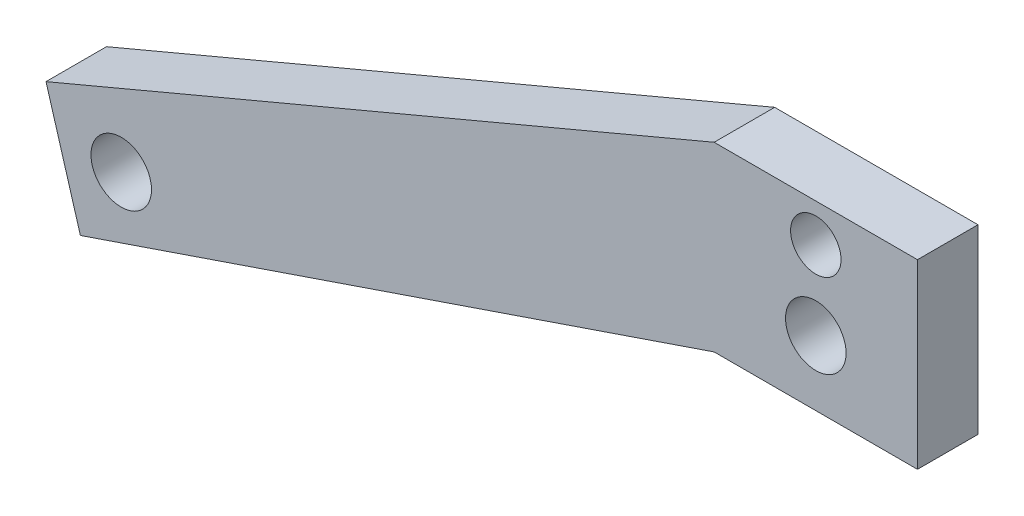
ISO-10303-21;
HEADER;
FILE_DESCRIPTION(('STEP AP214'),'2;1');
FILE_NAME('part.step','',(''),(''),'','','');
FILE_SCHEMA(('AUTOMOTIVE_DESIGN { 1 0 10303 214 1 1 1 1 }'));
ENDSEC;
DATA;
#1=APPLICATION_CONTEXT('core data for automotive mechanical design processes');
#2=APPLICATION_PROTOCOL_DEFINITION('international standard','automotive_design',2000,#1);
#3=PRODUCT_CONTEXT('',#1,'mechanical');
#4=PRODUCT('Part','Part','',(#3));
#5=PRODUCT_RELATED_PRODUCT_CATEGORY('part','',(#4));
#6=PRODUCT_DEFINITION_FORMATION('','',#4);
#7=PRODUCT_DEFINITION_CONTEXT('part definition',#1,'design');
#8=PRODUCT_DEFINITION('design','',#6,#7);
#9=PRODUCT_DEFINITION_SHAPE('','',#8);
#10=(LENGTH_UNIT() NAMED_UNIT(*) SI_UNIT(.MILLI.,.METRE.));
#11=(NAMED_UNIT(*) PLANE_ANGLE_UNIT() SI_UNIT($,.RADIAN.));
#12=(NAMED_UNIT(*) SI_UNIT($,.STERADIAN.) SOLID_ANGLE_UNIT());
#13=UNCERTAINTY_MEASURE_WITH_UNIT(LENGTH_MEASURE(1.E-05),#10,'distance_accuracy_value','');
#14=(GEOMETRIC_REPRESENTATION_CONTEXT(3) GLOBAL_UNCERTAINTY_ASSIGNED_CONTEXT((#13)) GLOBAL_UNIT_ASSIGNED_CONTEXT((#10,
#11,#12)) REPRESENTATION_CONTEXT('',''));
#15=CARTESIAN_POINT('',(0.,0.,0.));
#16=DIRECTION('',(0.,0.,1.));
#17=DIRECTION('',(1.,0.,0.));
#18=AXIS2_PLACEMENT_3D('',#15,#16,#17);
#19=CARTESIAN_POINT('',(-111.181731184165,-32.9335291699961,9.525));
#20=DIRECTION('',(-0.958819734868193,-0.284015344703924,0.));
#21=DIRECTION('',(0.284015344703924,-0.958819734868193,0.));
#22=AXIS2_PLACEMENT_3D('',#19,#20,#21);
#23=PLANE('',#22);
#24=DIRECTION('',(-0.284015344703924,0.958819734868193,0.));
#25=VECTOR('',#24,1.);
#26=CARTESIAN_POINT('',(-111.181731184165,-32.9335291699961,0.));
#27=LINE('',#26,#25);
#28=CARTESIAN_POINT('',(-115.733139183861,-17.5682332698922,0.));
#29=VERTEX_POINT('',#28);
#30=CARTESIAN_POINT('',(-121.143631500471,0.697282679346885,0.));
#31=VERTEX_POINT('',#30);
#32=EDGE_CURVE('E129',#29,#31,#27,.T.);
#33=ORIENTED_EDGE('',*,*,#32,.F.);
#34=DIRECTION('',(0.,0.,-1.));
#35=VECTOR('',#34,1.);
#36=CARTESIAN_POINT('',(-115.733139183861,-17.5682332698922,9.525));
#37=LINE('',#36,#35);
#38=CARTESIAN_POINT('',(-115.733139183861,-17.5682332698922,9.525));
#39=VERTEX_POINT('',#38);
#40=EDGE_CURVE('E11',#39,#29,#37,.T.);
#41=ORIENTED_EDGE('',*,*,#40,.F.);
#42=DIRECTION('',(-0.284015344703924,0.958819734868193,0.));
#43=VECTOR('',#42,1.);
#44=CARTESIAN_POINT('',(-111.181731184165,-32.9335291699961,9.525));
#45=LINE('',#44,#43);
#46=CARTESIAN_POINT('',(-121.143631500471,0.697282679346885,9.525));
#47=VERTEX_POINT('',#46);
#48=EDGE_CURVE('E253',#39,#47,#45,.T.);
#49=ORIENTED_EDGE('',*,*,#48,.T.);
#50=DIRECTION('',(0.,0.,-1.));
#51=VECTOR('',#50,1.);
#52=CARTESIAN_POINT('',(-121.143631500471,0.697282679346885,9.525));
#53=LINE('',#52,#51);
#54=EDGE_CURVE('E79',#47,#31,#53,.T.);
#55=ORIENTED_EDGE('',*,*,#54,.T.);
#56=EDGE_LOOP('',(#33,#41,#49,#55));
#57=FACE_BOUND('',#56,.T.);
#58=ADVANCED_FACE('F34',(#57),#23,.T.);
#59=CARTESIAN_POINT('',(-6.68093946845817,19.6012995194307,9.525));
#60=DIRECTION('',(0.322616747331422,-0.946529679588175,0.));
#61=DIRECTION('',(0.946529679588175,0.322616747331422,0.));
#62=AXIS2_PLACEMENT_3D('',#59,#60,#61);
#63=PLANE('',#62);
#64=DIRECTION('',(-0.946529679588175,-0.322616747331422,0.));
#65=VECTOR('',#64,1.);
#66=CARTESIAN_POINT('',(-6.68093946845817,19.6012995194307,0.));
#67=LINE('',#66,#65);
#68=CARTESIAN_POINT('',(-15.9999937728734,16.4249775796861,0.));
#69=VERTEX_POINT('',#68);
#70=EDGE_CURVE('E127',#69,#29,#67,.T.);
#71=ORIENTED_EDGE('',*,*,#70,.F.);
#72=DIRECTION('',(0.,0.,-1.));
#73=VECTOR('',#72,1.);
#74=CARTESIAN_POINT('',(-15.9999937728734,16.4249775796861,9.525));
#75=LINE('',#74,#73);
#76=CARTESIAN_POINT('',(-15.9999937728734,16.4249775796861,9.525));
#77=VERTEX_POINT('',#76);
#78=EDGE_CURVE('E43',#77,#69,#75,.T.);
#79=ORIENTED_EDGE('',*,*,#78,.F.);
#80=DIRECTION('',(-0.946529679588175,-0.322616747331422,0.));
#81=VECTOR('',#80,1.);
#82=CARTESIAN_POINT('',(-6.68093946845817,19.6012995194307,9.525));
#83=LINE('',#82,#81);
#84=EDGE_CURVE('E254',#77,#39,#83,.T.);
#85=ORIENTED_EDGE('',*,*,#84,.T.);
#86=ORIENTED_EDGE('',*,*,#40,.T.);
#87=EDGE_LOOP('',(#71,#79,#85,#86));
#88=FACE_BOUND('',#87,.T.);
#89=ADVANCED_FACE('F128',(#88),#63,.T.);
#90=CARTESIAN_POINT('',(0.,16.4249775796861,9.525));
#91=DIRECTION('',(0.,-1.,0.));
#92=DIRECTION('',(1.,0.,0.));
#93=AXIS2_PLACEMENT_3D('',#90,#91,#92);
#94=PLANE('',#93);
#95=DIRECTION('',(-1.,0.,0.));
#96=VECTOR('',#95,1.);
#97=CARTESIAN_POINT('',(0.,16.4249775796861,0.));
#98=LINE('',#97,#96);
#99=CARTESIAN_POINT('',(16.0000062271267,16.4249775796861,0.));
#100=VERTEX_POINT('',#99);
#101=EDGE_CURVE('E123',#100,#69,#98,.T.);
#102=ORIENTED_EDGE('',*,*,#101,.F.);
#103=DIRECTION('',(0.,0.,-1.));
#104=VECTOR('',#103,1.);
#105=CARTESIAN_POINT('',(16.0000062271267,16.4249775796861,9.525));
#106=LINE('',#105,#104);
#107=CARTESIAN_POINT('',(16.0000062271267,16.4249775796861,9.525));
#108=VERTEX_POINT('',#107);
#109=EDGE_CURVE('E113',#108,#100,#106,.T.);
#110=ORIENTED_EDGE('',*,*,#109,.F.);
#111=DIRECTION('',(-1.,0.,0.));
#112=VECTOR('',#111,1.);
#113=CARTESIAN_POINT('',(0.,16.4249775796861,9.525));
#114=LINE('',#113,#112);
#115=EDGE_CURVE('E107',#108,#77,#114,.T.);
#116=ORIENTED_EDGE('',*,*,#115,.T.);
#117=ORIENTED_EDGE('',*,*,#78,.T.);
#118=EDGE_LOOP('',(#102,#110,#116,#117));
#119=FACE_BOUND('',#118,.T.);
#120=ADVANCED_FACE('F121',(#119),#94,.T.);
#121=CARTESIAN_POINT('',(16.0000062271267,0.,9.525));
#122=DIRECTION('',(-1.,0.,0.));
#123=DIRECTION('',(0.,-1.,0.));
#124=AXIS2_PLACEMENT_3D('',#121,#122,#123);
#125=PLANE('',#124);
#126=DIRECTION('',(0.,1.,0.));
#127=VECTOR('',#126,1.);
#128=CARTESIAN_POINT('',(16.0000062271267,0.,0.));
#129=LINE('',#128,#127);
#130=CARTESIAN_POINT('',(16.0000062271267,44.9999775796863,0.));
#131=VERTEX_POINT('',#130);
#132=EDGE_CURVE('E112',#100,#131,#129,.T.);
#133=ORIENTED_EDGE('',*,*,#132,.T.);
#134=DIRECTION('',(0.,0.,-1.));
#135=VECTOR('',#134,1.);
#136=CARTESIAN_POINT('',(16.0000062271267,44.9999775796863,9.525));
#137=LINE('',#136,#135);
#138=CARTESIAN_POINT('',(16.0000062271267,44.9999775796863,9.525));
#139=VERTEX_POINT('',#138);
#140=EDGE_CURVE('E97',#139,#131,#137,.T.);
#141=ORIENTED_EDGE('',*,*,#140,.F.);
#142=DIRECTION('',(0.,1.,0.));
#143=VECTOR('',#142,1.);
#144=CARTESIAN_POINT('',(16.0000062271267,0.,9.525));
#145=LINE('',#144,#143);
#146=EDGE_CURVE('E100',#108,#139,#145,.T.);
#147=ORIENTED_EDGE('',*,*,#146,.F.);
#148=ORIENTED_EDGE('',*,*,#109,.T.);
#149=EDGE_LOOP('',(#133,#141,#147,#148));
#150=FACE_BOUND('',#149,.T.);
#151=ADVANCED_FACE('F110',(#150),#125,.F.);
#152=CARTESIAN_POINT('',(0.,44.9999775796863,9.525));
#153=DIRECTION('',(0.,-1.,0.));
#154=DIRECTION('',(0.,0.,-1.));
#155=AXIS2_PLACEMENT_3D('',#152,#153,#154);
#156=PLANE('',#155);
#157=DIRECTION('',(-1.,0.,0.));
#158=VECTOR('',#157,1.);
#159=CARTESIAN_POINT('',(0.,44.9999775796863,0.));
#160=LINE('',#159,#158);
#161=CARTESIAN_POINT('',(-15.9999937728733,44.9999775796863,0.));
#162=VERTEX_POINT('',#161);
#163=EDGE_CURVE('E133',#131,#162,#160,.T.);
#164=ORIENTED_EDGE('',*,*,#163,.T.);
#165=DIRECTION('',(0.,0.,-1.));
#166=VECTOR('',#165,1.);
#167=CARTESIAN_POINT('',(-15.9999937728733,44.9999775796863,9.525));
#168=LINE('',#167,#166);
#169=CARTESIAN_POINT('',(-15.9999937728733,44.9999775796863,9.525));
#170=VERTEX_POINT('',#169);
#171=EDGE_CURVE('E99',#170,#162,#168,.T.);
#172=ORIENTED_EDGE('',*,*,#171,.F.);
#173=DIRECTION('',(-1.,0.,0.));
#174=VECTOR('',#173,1.);
#175=CARTESIAN_POINT('',(0.,44.9999775796863,9.525));
#176=LINE('',#175,#174);
#177=EDGE_CURVE('E92',#139,#170,#176,.T.);
#178=ORIENTED_EDGE('',*,*,#177,.F.);
#179=ORIENTED_EDGE('',*,*,#140,.T.);
#180=EDGE_LOOP('',(#164,#172,#178,#179));
#181=FACE_BOUND('',#180,.T.);
#182=ADVANCED_FACE('F95',(#181),#156,.F.);
#183=CARTESIAN_POINT('',(6.22712671610374E-06,38.9999775796863,9.525));
#184=DIRECTION('',(0.,0.,-1.));
#185=DIRECTION('',(-1.,0.,0.));
#186=AXIS2_PLACEMENT_3D('',#183,#184,#185);
#187=CYLINDRICAL_SURFACE('',#186,3.96875);
#188=CARTESIAN_POINT('',(6.22712671610374E-06,38.9999775796863,9.525));
#189=DIRECTION('',(0.,0.,1.));
#190=DIRECTION('',(1.,0.,0.));
#191=AXIS2_PLACEMENT_3D('',#188,#189,#190);
#192=CIRCLE('',#191,3.96875);
#193=CARTESIAN_POINT('',(3.96875622712672,38.9999775796863,9.525));
#194=VERTEX_POINT('',#193);
#195=EDGE_CURVE('E255',#194,#194,#192,.T.);
#196=ORIENTED_EDGE('',*,*,#195,.T.);
#197=EDGE_LOOP('',(#196));
#198=FACE_BOUND('',#197,.T.);
#199=CARTESIAN_POINT('',(6.22712671610374E-06,38.9999775796863,0.));
#200=DIRECTION('',(0.,0.,1.));
#201=DIRECTION('',(1.,0.,0.));
#202=AXIS2_PLACEMENT_3D('',#199,#200,#201);
#203=CIRCLE('',#202,3.96875);
#204=CARTESIAN_POINT('',(3.96875622712672,38.9999775796863,0.));
#205=VERTEX_POINT('',#204);
#206=EDGE_CURVE('E147',#205,#205,#203,.T.);
#207=ORIENTED_EDGE('',*,*,#206,.F.);
#208=EDGE_LOOP('',(#207));
#209=FACE_BOUND('',#208,.T.);
#210=ADVANCED_FACE('F157',(#198,#209),#187,.F.);
#211=CARTESIAN_POINT('',(6.23902837032508E-06,26.6475746126805,9.525));
#212=DIRECTION('',(0.,0.,-1.));
#213=DIRECTION('',(-1.,0.,0.));
#214=AXIS2_PLACEMENT_3D('',#211,#212,#213);
#215=CYLINDRICAL_SURFACE('',#214,4.76250000164186);
#216=CARTESIAN_POINT('',(6.23902837032508E-06,26.6475746126805,9.525));
#217=DIRECTION('',(0.,0.,1.));
#218=DIRECTION('',(1.,0.,0.));
#219=AXIS2_PLACEMENT_3D('',#216,#217,#218);
#220=CIRCLE('',#219,4.76250000164186);
#221=CARTESIAN_POINT('',(4.76250624067023,26.6475746126805,9.525));
#222=VERTEX_POINT('',#221);
#223=EDGE_CURVE('E171',#222,#222,#220,.T.);
#224=ORIENTED_EDGE('',*,*,#223,.T.);
#225=EDGE_LOOP('',(#224));
#226=FACE_BOUND('',#225,.T.);
#227=CARTESIAN_POINT('',(6.23902837032508E-06,26.6475746126805,0.));
#228=DIRECTION('',(0.,0.,1.));
#229=DIRECTION('',(1.,0.,0.));
#230=AXIS2_PLACEMENT_3D('',#227,#228,#229);
#231=CIRCLE('',#230,4.76250000164186);
#232=CARTESIAN_POINT('',(4.76250624067023,26.6475746126805,0.));
#233=VERTEX_POINT('',#232);
#234=EDGE_CURVE('E144',#233,#233,#231,.T.);
#235=ORIENTED_EDGE('',*,*,#234,.F.);
#236=EDGE_LOOP('',(#235));
#237=FACE_BOUND('',#236,.T.);
#238=ADVANCED_FACE('F159',(#226,#237),#215,.F.);
#239=CARTESIAN_POINT('',(-109.305627367547,-5.73022913696779,9.525));
#240=DIRECTION('',(0.,0.,-1.));
#241=DIRECTION('',(-1.,0.,0.));
#242=AXIS2_PLACEMENT_3D('',#239,#240,#241);
#243=CYLINDRICAL_SURFACE('',#242,4.76250000164186);
#244=CARTESIAN_POINT('',(-109.305627367547,-5.73022913696779,9.525));
#245=DIRECTION('',(0.,0.,1.));
#246=DIRECTION('',(1.,0.,0.));
#247=AXIS2_PLACEMENT_3D('',#244,#245,#246);
#248=CIRCLE('',#247,4.76250000164186);
#249=CARTESIAN_POINT('',(-104.543127365905,-5.73022913696779,9.525));
#250=VERTEX_POINT('',#249);
#251=EDGE_CURVE('E138',#250,#250,#248,.T.);
#252=ORIENTED_EDGE('',*,*,#251,.T.);
#253=EDGE_LOOP('',(#252));
#254=FACE_BOUND('',#253,.T.);
#255=CARTESIAN_POINT('',(-109.305627367547,-5.73022913696779,0.));
#256=DIRECTION('',(0.,0.,1.));
#257=DIRECTION('',(1.,0.,0.));
#258=AXIS2_PLACEMENT_3D('',#255,#256,#257);
#259=CIRCLE('',#258,4.76250000164186);
#260=CARTESIAN_POINT('',(-104.543127365905,-5.73022913696779,0.));
#261=VERTEX_POINT('',#260);
#262=EDGE_CURVE('E141',#261,#261,#259,.T.);
#263=ORIENTED_EDGE('',*,*,#262,.F.);
#264=EDGE_LOOP('',(#263));
#265=FACE_BOUND('',#264,.T.);
#266=ADVANCED_FACE('F36',(#254,#265),#243,.F.);
#267=CARTESIAN_POINT('',(-18.5144984661136,43.9404809077269,9.525));
#268=DIRECTION('',(0.388292906680553,-0.921536010485519,0.));
#269=DIRECTION('',(0.921536010485519,0.388292906680553,0.));
#270=AXIS2_PLACEMENT_3D('',#267,#268,#269);
#271=PLANE('',#270);
#272=DIRECTION('',(-0.921536010485519,-0.388292906680553,0.));
#273=VECTOR('',#272,1.);
#274=CARTESIAN_POINT('',(-18.5144984661136,43.9404809077269,0.));
#275=LINE('',#274,#273);
#276=EDGE_CURVE('E72',#162,#31,#275,.T.);
#277=ORIENTED_EDGE('',*,*,#276,.T.);
#278=ORIENTED_EDGE('',*,*,#54,.F.);
#279=DIRECTION('',(-0.921536010485519,-0.388292906680553,0.));
#280=VECTOR('',#279,1.);
#281=CARTESIAN_POINT('',(-18.5144984661136,43.9404809077269,9.525));
#282=LINE('',#281,#280);
#283=EDGE_CURVE('E51',#170,#47,#282,.T.);
#284=ORIENTED_EDGE('',*,*,#283,.F.);
#285=ORIENTED_EDGE('',*,*,#171,.T.);
#286=EDGE_LOOP('',(#277,#278,#284,#285));
#287=FACE_BOUND('',#286,.T.);
#288=ADVANCED_FACE('F166',(#287),#271,.F.);
#289=CARTESIAN_POINT('',(0.,0.,9.525));
#290=DIRECTION('',(0.,0.,1.));
#291=DIRECTION('',(1.,0.,0.));
#292=AXIS2_PLACEMENT_3D('',#289,#290,#291);
#293=PLANE('',#292);
#294=ORIENTED_EDGE('',*,*,#251,.F.);
#295=EDGE_LOOP('',(#294));
#296=FACE_BOUND('',#295,.T.);
#297=ORIENTED_EDGE('',*,*,#223,.F.);
#298=EDGE_LOOP('',(#297));
#299=FACE_BOUND('',#298,.T.);
#300=ORIENTED_EDGE('',*,*,#195,.F.);
#301=EDGE_LOOP('',(#300));
#302=FACE_BOUND('',#301,.T.);
#303=ORIENTED_EDGE('',*,*,#48,.F.);
#304=ORIENTED_EDGE('',*,*,#84,.F.);
#305=ORIENTED_EDGE('',*,*,#115,.F.);
#306=ORIENTED_EDGE('',*,*,#146,.T.);
#307=ORIENTED_EDGE('',*,*,#177,.T.);
#308=ORIENTED_EDGE('',*,*,#283,.T.);
#309=EDGE_LOOP('',(#303,#304,#305,#306,#307,#308));
#310=FACE_BOUND('',#309,.T.);
#311=ADVANCED_FACE('F104',(#296,#299,#302,#310),#293,.T.);
#312=CARTESIAN_POINT('',(0.,0.,0.));
#313=DIRECTION('',(0.,0.,1.));
#314=DIRECTION('',(1.,0.,0.));
#315=AXIS2_PLACEMENT_3D('',#312,#313,#314);
#316=PLANE('',#315);
#317=ORIENTED_EDGE('',*,*,#262,.T.);
#318=EDGE_LOOP('',(#317));
#319=FACE_BOUND('',#318,.T.);
#320=ORIENTED_EDGE('',*,*,#234,.T.);
#321=EDGE_LOOP('',(#320));
#322=FACE_BOUND('',#321,.T.);
#323=ORIENTED_EDGE('',*,*,#206,.T.);
#324=EDGE_LOOP('',(#323));
#325=FACE_BOUND('',#324,.T.);
#326=ORIENTED_EDGE('',*,*,#32,.T.);
#327=ORIENTED_EDGE('',*,*,#276,.F.);
#328=ORIENTED_EDGE('',*,*,#163,.F.);
#329=ORIENTED_EDGE('',*,*,#132,.F.);
#330=ORIENTED_EDGE('',*,*,#101,.T.);
#331=ORIENTED_EDGE('',*,*,#70,.T.);
#332=EDGE_LOOP('',(#326,#327,#328,#329,#330,#331));
#333=FACE_BOUND('',#332,.T.);
#334=ADVANCED_FACE('F131',(#319,#322,#325,#333),#316,.F.);
#335=CLOSED_SHELL('',(#58,#89,#120,#151,#182,#210,#238,#266,#288,#311,#334));
#336=MANIFOLD_SOLID_BREP('B2',#335);
#337=ADVANCED_BREP_SHAPE_REPRESENTATION('',(#18,#336),#14);
#338=SHAPE_DEFINITION_REPRESENTATION(#9,#337);
ENDSEC;
END-ISO-10303-21;
